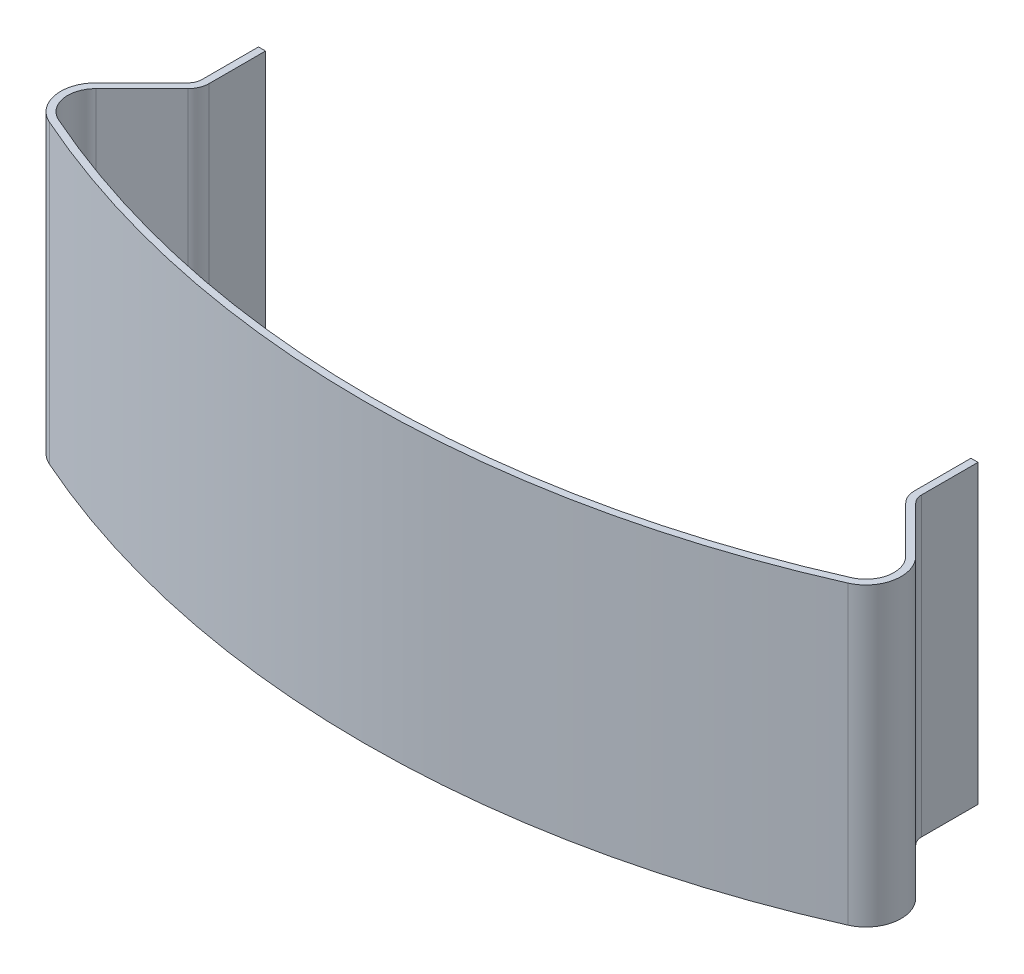
ISO-10303-21;
HEADER;
FILE_DESCRIPTION(('STEP AP214'),'2;1');
FILE_NAME('part.step','',(''),(''),'','','');
FILE_SCHEMA(('AUTOMOTIVE_DESIGN { 1 0 10303 214 1 1 1 1 }'));
ENDSEC;
DATA;
#1=APPLICATION_CONTEXT('core data for automotive mechanical design processes');
#2=APPLICATION_PROTOCOL_DEFINITION('international standard','automotive_design',2000,#1);
#3=PRODUCT_CONTEXT('',#1,'mechanical');
#4=PRODUCT('Part','Part','',(#3));
#5=PRODUCT_RELATED_PRODUCT_CATEGORY('part','',(#4));
#6=PRODUCT_DEFINITION_FORMATION('','',#4);
#7=PRODUCT_DEFINITION_CONTEXT('part definition',#1,'design');
#8=PRODUCT_DEFINITION('design','',#6,#7);
#9=PRODUCT_DEFINITION_SHAPE('','',#8);
#10=(LENGTH_UNIT() NAMED_UNIT(*) SI_UNIT(.MILLI.,.METRE.));
#11=(NAMED_UNIT(*) PLANE_ANGLE_UNIT() SI_UNIT($,.RADIAN.));
#12=(NAMED_UNIT(*) SI_UNIT($,.STERADIAN.) SOLID_ANGLE_UNIT());
#13=UNCERTAINTY_MEASURE_WITH_UNIT(LENGTH_MEASURE(1.E-05),#10,'distance_accuracy_value','');
#14=(GEOMETRIC_REPRESENTATION_CONTEXT(3) GLOBAL_UNCERTAINTY_ASSIGNED_CONTEXT((#13)) GLOBAL_UNIT_ASSIGNED_CONTEXT((#10,
#11,#12)) REPRESENTATION_CONTEXT('',''));
#15=CARTESIAN_POINT('',(0.,0.,0.));
#16=DIRECTION('',(0.,0.,1.));
#17=DIRECTION('',(1.,0.,0.));
#18=AXIS2_PLACEMENT_3D('',#15,#16,#17);
#19=CARTESIAN_POINT('',(-54.5767367898602,42.,123.476231726476));
#20=DIRECTION('',(0.,-1.,0.));
#21=DIRECTION('',(0.,0.,-1.));
#22=AXIS2_PLACEMENT_3D('',#19,#20,#21);
#23=CYLINDRICAL_SURFACE('',#22,4.9999999999998);
#24=CARTESIAN_POINT('',(-54.5767367898602,0.,123.476231726476));
#25=DIRECTION('',(0.,1.,0.));
#26=DIRECTION('',(0.,0.,-1.));
#27=AXIS2_PLACEMENT_3D('',#24,#25,#26);
#28=CIRCLE('',#27,4.9999999999998);
#29=CARTESIAN_POINT('',(-58.1122706957928,0.,119.940697820543));
#30=VERTEX_POINT('',#29);
#31=CARTESIAN_POINT('',(-56.5980974117069,0.,128.049425494123));
#32=VERTEX_POINT('',#31);
#33=EDGE_CURVE('E201',#30,#32,#28,.T.);
#34=ORIENTED_EDGE('',*,*,#33,.T.);
#35=DIRECTION('',(0.,-1.,0.));
#36=VECTOR('',#35,1.);
#37=CARTESIAN_POINT('',(-56.5980974117069,42.,128.049425494123));
#38=LINE('',#37,#36);
#39=CARTESIAN_POINT('',(-56.5980974117069,42.,128.049425494123));
#40=VERTEX_POINT('',#39);
#41=EDGE_CURVE('E11',#40,#32,#38,.T.);
#42=ORIENTED_EDGE('',*,*,#41,.F.);
#43=CARTESIAN_POINT('',(-54.5767367898602,42.,123.476231726476));
#44=DIRECTION('',(0.,1.,0.));
#45=DIRECTION('',(0.,0.,-1.));
#46=AXIS2_PLACEMENT_3D('',#43,#44,#45);
#47=CIRCLE('',#46,4.9999999999998);
#48=CARTESIAN_POINT('',(-58.1122706957928,42.,119.940697820543));
#49=VERTEX_POINT('',#48);
#50=EDGE_CURVE('E239',#49,#40,#47,.T.);
#51=ORIENTED_EDGE('',*,*,#50,.F.);
#52=DIRECTION('',(0.,-1.,0.));
#53=VECTOR('',#52,1.);
#54=CARTESIAN_POINT('',(-58.1122706957928,42.,119.940697820543));
#55=LINE('',#54,#53);
#56=EDGE_CURVE('E197',#49,#30,#55,.T.);
#57=ORIENTED_EDGE('',*,*,#56,.T.);
#58=EDGE_LOOP('',(#34,#42,#51,#57));
#59=FACE_BOUND('',#58,.T.);
#60=ADVANCED_FACE('F33',(#59),#23,.T.);
#61=CARTESIAN_POINT('',(0.,42.,0.));
#62=DIRECTION('',(0.,-1.,0.));
#63=DIRECTION('',(0.,0.,-1.));
#64=AXIS2_PLACEMENT_3D('',#61,#62,#63);
#65=CYLINDRICAL_SURFACE('',#64,140.);
#66=CARTESIAN_POINT('',(0.,0.,0.));
#67=DIRECTION('',(0.,1.,0.));
#68=DIRECTION('',(0.,0.,1.));
#69=AXIS2_PLACEMENT_3D('',#66,#67,#68);
#70=CIRCLE('',#69,140.);
#71=CARTESIAN_POINT('',(56.5980974117069,0.,128.049425494123));
#72=VERTEX_POINT('',#71);
#73=EDGE_CURVE('E204',#32,#72,#70,.T.);
#74=ORIENTED_EDGE('',*,*,#73,.T.);
#75=DIRECTION('',(0.,-1.,0.));
#76=VECTOR('',#75,1.);
#77=CARTESIAN_POINT('',(56.5980974117069,42.,128.049425494123));
#78=LINE('',#77,#76);
#79=CARTESIAN_POINT('',(56.5980974117069,42.,128.049425494123));
#80=VERTEX_POINT('',#79);
#81=EDGE_CURVE('E41',#80,#72,#78,.T.);
#82=ORIENTED_EDGE('',*,*,#81,.F.);
#83=CARTESIAN_POINT('',(0.,42.,0.));
#84=DIRECTION('',(0.,1.,0.));
#85=DIRECTION('',(0.,0.,1.));
#86=AXIS2_PLACEMENT_3D('',#83,#84,#85);
#87=CIRCLE('',#86,140.);
#88=EDGE_CURVE('E128',#40,#80,#87,.T.);
#89=ORIENTED_EDGE('',*,*,#88,.F.);
#90=ORIENTED_EDGE('',*,*,#41,.T.);
#91=EDGE_LOOP('',(#74,#82,#89,#90));
#92=FACE_BOUND('',#91,.T.);
#93=ADVANCED_FACE('F357',(#92),#65,.T.);
#94=CARTESIAN_POINT('',(54.5767367898602,42.,123.476231726476));
#95=DIRECTION('',(0.,-1.,0.));
#96=DIRECTION('',(0.,0.,-1.));
#97=AXIS2_PLACEMENT_3D('',#94,#95,#96);
#98=CYLINDRICAL_SURFACE('',#97,4.99999999999981);
#99=CARTESIAN_POINT('',(54.5767367898602,0.,123.476231726476));
#100=DIRECTION('',(0.,1.,0.));
#101=DIRECTION('',(0.,0.,1.));
#102=AXIS2_PLACEMENT_3D('',#99,#100,#101);
#103=CIRCLE('',#102,4.99999999999981);
#104=CARTESIAN_POINT('',(58.1122706957952,0.,119.940697820546));
#105=VERTEX_POINT('',#104);
#106=EDGE_CURVE('E206',#72,#105,#103,.T.);
#107=ORIENTED_EDGE('',*,*,#106,.T.);
#108=DIRECTION('',(0.,-1.,0.));
#109=VECTOR('',#108,1.);
#110=CARTESIAN_POINT('',(58.1122706957952,42.,119.940697820546));
#111=LINE('',#110,#109);
#112=CARTESIAN_POINT('',(58.1122706957952,42.,119.940697820546));
#113=VERTEX_POINT('',#112);
#114=EDGE_CURVE('E282',#113,#105,#111,.T.);
#115=ORIENTED_EDGE('',*,*,#114,.F.);
#116=CARTESIAN_POINT('',(54.5767367898602,42.,123.476231726476));
#117=DIRECTION('',(0.,1.,0.));
#118=DIRECTION('',(0.,0.,1.));
#119=AXIS2_PLACEMENT_3D('',#116,#117,#118);
#120=CIRCLE('',#119,4.99999999999981);
#121=EDGE_CURVE('E290',#80,#113,#120,.T.);
#122=ORIENTED_EDGE('',*,*,#121,.F.);
#123=ORIENTED_EDGE('',*,*,#81,.T.);
#124=EDGE_LOOP('',(#107,#115,#122,#123));
#125=FACE_BOUND('',#124,.T.);
#126=ADVANCED_FACE('F288',(#125),#98,.T.);
#127=CARTESIAN_POINT('',(58.1122706957952,42.,119.940697820546));
#128=DIRECTION('',(-0.707106781187015,0.,0.70710678118608));
#129=DIRECTION('',(0.70710678118608,0.,0.707106781187015));
#130=AXIS2_PLACEMENT_3D('',#127,#128,#129);
#131=PLANE('',#130);
#132=DIRECTION('',(-0.70710678118608,0.,-0.707106781187015));
#133=VECTOR('',#132,1.);
#134=CARTESIAN_POINT('',(58.1122706957952,0.,119.940697820546));
#135=LINE('',#134,#133);
#136=CARTESIAN_POINT('',(51.5857864376303,0.,113.414213562372));
#137=VERTEX_POINT('',#136);
#138=EDGE_CURVE('E208',#105,#137,#135,.T.);
#139=ORIENTED_EDGE('',*,*,#138,.T.);
#140=DIRECTION('',(0.,-1.,0.));
#141=VECTOR('',#140,1.);
#142=CARTESIAN_POINT('',(51.5857864376303,42.,113.414213562372));
#143=LINE('',#142,#141);
#144=CARTESIAN_POINT('',(51.5857864376303,42.,113.414213562372));
#145=VERTEX_POINT('',#144);
#146=EDGE_CURVE('E279',#145,#137,#143,.T.);
#147=ORIENTED_EDGE('',*,*,#146,.F.);
#148=DIRECTION('',(-0.70710678118608,0.,-0.707106781187015));
#149=VECTOR('',#148,1.);
#150=CARTESIAN_POINT('',(58.1122706957952,42.,119.940697820546));
#151=LINE('',#150,#149);
#152=EDGE_CURVE('E308',#113,#145,#151,.T.);
#153=ORIENTED_EDGE('',*,*,#152,.F.);
#154=ORIENTED_EDGE('',*,*,#114,.T.);
#155=EDGE_LOOP('',(#139,#147,#153,#154));
#156=FACE_BOUND('',#155,.T.);
#157=ADVANCED_FACE('F299',(#156),#131,.F.);
#158=CARTESIAN_POINT('',(53.0000000000044,42.,112.));
#159=DIRECTION('',(0.,-1.,0.));
#160=DIRECTION('',(0.,0.,-1.));
#161=AXIS2_PLACEMENT_3D('',#158,#159,#160);
#162=CYLINDRICAL_SURFACE('',#161,2.);
#163=CARTESIAN_POINT('',(53.0000000000044,0.,112.));
#164=DIRECTION('',(0.,-1.,0.));
#165=DIRECTION('',(0.,0.,-1.));
#166=AXIS2_PLACEMENT_3D('',#163,#164,#165);
#167=CIRCLE('',#166,2.);
#168=CARTESIAN_POINT('',(51.0000000000044,0.,112.));
#169=VERTEX_POINT('',#168);
#170=EDGE_CURVE('E210',#137,#169,#167,.T.);
#171=ORIENTED_EDGE('',*,*,#170,.T.);
#172=DIRECTION('',(0.,-1.,0.));
#173=VECTOR('',#172,1.);
#174=CARTESIAN_POINT('',(51.0000000000044,42.,112.));
#175=LINE('',#174,#173);
#176=CARTESIAN_POINT('',(51.0000000000044,42.,112.));
#177=VERTEX_POINT('',#176);
#178=EDGE_CURVE('E276',#177,#169,#175,.T.);
#179=ORIENTED_EDGE('',*,*,#178,.F.);
#180=CARTESIAN_POINT('',(53.0000000000044,42.,112.));
#181=DIRECTION('',(0.,-1.,0.));
#182=DIRECTION('',(0.,0.,-1.));
#183=AXIS2_PLACEMENT_3D('',#180,#181,#182);
#184=CIRCLE('',#183,2.);
#185=EDGE_CURVE('E305',#145,#177,#184,.T.);
#186=ORIENTED_EDGE('',*,*,#185,.F.);
#187=ORIENTED_EDGE('',*,*,#146,.T.);
#188=EDGE_LOOP('',(#171,#179,#186,#187));
#189=FACE_BOUND('',#188,.T.);
#190=ADVANCED_FACE('F303',(#189),#162,.F.);
#191=CARTESIAN_POINT('',(51.0000000000044,42.,112.));
#192=DIRECTION('',(-1.,0.,0.));
#193=DIRECTION('',(0.,0.,1.));
#194=AXIS2_PLACEMENT_3D('',#191,#192,#193);
#195=PLANE('',#194);
#196=DIRECTION('',(0.,0.,-1.));
#197=VECTOR('',#196,1.);
#198=CARTESIAN_POINT('',(51.0000000000044,0.,112.));
#199=LINE('',#198,#197);
#200=CARTESIAN_POINT('',(51.0000000000044,0.,104.));
#201=VERTEX_POINT('',#200);
#202=EDGE_CURVE('E212',#169,#201,#199,.T.);
#203=ORIENTED_EDGE('',*,*,#202,.T.);
#204=DIRECTION('',(0.,-1.,0.));
#205=VECTOR('',#204,1.);
#206=CARTESIAN_POINT('',(51.0000000000044,42.,104.));
#207=LINE('',#206,#205);
#208=CARTESIAN_POINT('',(51.0000000000044,42.,104.));
#209=VERTEX_POINT('',#208);
#210=EDGE_CURVE('E273',#209,#201,#207,.T.);
#211=ORIENTED_EDGE('',*,*,#210,.F.);
#212=DIRECTION('',(0.,0.,-1.));
#213=VECTOR('',#212,1.);
#214=CARTESIAN_POINT('',(51.0000000000044,42.,112.));
#215=LINE('',#214,#213);
#216=EDGE_CURVE('E307',#177,#209,#215,.T.);
#217=ORIENTED_EDGE('',*,*,#216,.F.);
#218=ORIENTED_EDGE('',*,*,#178,.T.);
#219=EDGE_LOOP('',(#203,#211,#217,#218));
#220=FACE_BOUND('',#219,.T.);
#221=ADVANCED_FACE('F370',(#220),#195,.F.);
#222=CARTESIAN_POINT('',(51.0000000000044,42.,104.));
#223=DIRECTION('',(0.,0.,1.));
#224=DIRECTION('',(1.,0.,0.));
#225=AXIS2_PLACEMENT_3D('',#222,#223,#224);
#226=PLANE('',#225);
#227=DIRECTION('',(-1.,0.,0.));
#228=VECTOR('',#227,1.);
#229=CARTESIAN_POINT('',(51.0000000000044,0.,104.));
#230=LINE('',#229,#228);
#231=CARTESIAN_POINT('',(50.0000000000043,0.,104.));
#232=VERTEX_POINT('',#231);
#233=EDGE_CURVE('E214',#201,#232,#230,.T.);
#234=ORIENTED_EDGE('',*,*,#233,.T.);
#235=DIRECTION('',(0.,-1.,0.));
#236=VECTOR('',#235,1.);
#237=CARTESIAN_POINT('',(50.0000000000043,42.,104.));
#238=LINE('',#237,#236);
#239=CARTESIAN_POINT('',(50.0000000000043,42.,104.));
#240=VERTEX_POINT('',#239);
#241=EDGE_CURVE('E270',#240,#232,#238,.T.);
#242=ORIENTED_EDGE('',*,*,#241,.F.);
#243=DIRECTION('',(-1.,0.,0.));
#244=VECTOR('',#243,1.);
#245=CARTESIAN_POINT('',(51.0000000000044,42.,104.));
#246=LINE('',#245,#244);
#247=EDGE_CURVE('E310',#209,#240,#246,.T.);
#248=ORIENTED_EDGE('',*,*,#247,.F.);
#249=ORIENTED_EDGE('',*,*,#210,.T.);
#250=EDGE_LOOP('',(#234,#242,#248,#249));
#251=FACE_BOUND('',#250,.T.);
#252=ADVANCED_FACE('F373',(#251),#226,.F.);
#253=CARTESIAN_POINT('',(50.0000000000043,42.,104.));
#254=DIRECTION('',(1.,0.,0.));
#255=DIRECTION('',(0.,0.,-1.));
#256=AXIS2_PLACEMENT_3D('',#253,#254,#255);
#257=PLANE('',#256);
#258=DIRECTION('',(0.,0.,1.));
#259=VECTOR('',#258,1.);
#260=CARTESIAN_POINT('',(50.0000000000043,0.,104.));
#261=LINE('',#260,#259);
#262=CARTESIAN_POINT('',(50.0000000000043,0.,112.));
#263=VERTEX_POINT('',#262);
#264=EDGE_CURVE('E216',#232,#263,#261,.T.);
#265=ORIENTED_EDGE('',*,*,#264,.T.);
#266=DIRECTION('',(0.,-1.,0.));
#267=VECTOR('',#266,1.);
#268=CARTESIAN_POINT('',(50.0000000000043,42.,112.));
#269=LINE('',#268,#267);
#270=CARTESIAN_POINT('',(50.0000000000043,42.,112.));
#271=VERTEX_POINT('',#270);
#272=EDGE_CURVE('E267',#271,#263,#269,.T.);
#273=ORIENTED_EDGE('',*,*,#272,.F.);
#274=DIRECTION('',(0.,0.,1.));
#275=VECTOR('',#274,1.);
#276=CARTESIAN_POINT('',(50.0000000000043,42.,104.));
#277=LINE('',#276,#275);
#278=EDGE_CURVE('E316',#240,#271,#277,.T.);
#279=ORIENTED_EDGE('',*,*,#278,.F.);
#280=ORIENTED_EDGE('',*,*,#241,.T.);
#281=EDGE_LOOP('',(#265,#273,#279,#280));
#282=FACE_BOUND('',#281,.T.);
#283=ADVANCED_FACE('F377',(#282),#257,.F.);
#284=CARTESIAN_POINT('',(53.0000000000044,42.,112.));
#285=DIRECTION('',(0.,-1.,0.));
#286=DIRECTION('',(0.,0.,-1.));
#287=AXIS2_PLACEMENT_3D('',#284,#285,#286);
#288=CYLINDRICAL_SURFACE('',#287,3.00000000000002);
#289=CARTESIAN_POINT('',(53.0000000000044,0.,112.));
#290=DIRECTION('',(0.,1.,0.));
#291=DIRECTION('',(0.,0.,-1.));
#292=AXIS2_PLACEMENT_3D('',#289,#290,#291);
#293=CIRCLE('',#292,3.00000000000002);
#294=CARTESIAN_POINT('',(50.8786796564433,0.,114.121320343558));
#295=VERTEX_POINT('',#294);
#296=EDGE_CURVE('E218',#263,#295,#293,.T.);
#297=ORIENTED_EDGE('',*,*,#296,.T.);
#298=DIRECTION('',(0.,-1.,0.));
#299=VECTOR('',#298,1.);
#300=CARTESIAN_POINT('',(50.8786796564433,42.,114.121320343558));
#301=LINE('',#300,#299);
#302=CARTESIAN_POINT('',(50.8786796564433,42.,114.121320343558));
#303=VERTEX_POINT('',#302);
#304=EDGE_CURVE('E264',#303,#295,#301,.T.);
#305=ORIENTED_EDGE('',*,*,#304,.F.);
#306=CARTESIAN_POINT('',(53.0000000000044,42.,112.));
#307=DIRECTION('',(0.,1.,0.));
#308=DIRECTION('',(0.,0.,-1.));
#309=AXIS2_PLACEMENT_3D('',#306,#307,#308);
#310=CIRCLE('',#309,3.00000000000002);
#311=EDGE_CURVE('E318',#271,#303,#310,.T.);
#312=ORIENTED_EDGE('',*,*,#311,.F.);
#313=ORIENTED_EDGE('',*,*,#272,.T.);
#314=EDGE_LOOP('',(#297,#305,#312,#313));
#315=FACE_BOUND('',#314,.T.);
#316=ADVANCED_FACE('F381',(#315),#288,.T.);
#317=CARTESIAN_POINT('',(57.4051639146092,42.,120.647804601733));
#318=DIRECTION('',(0.707106781187015,0.,-0.70710678118608));
#319=DIRECTION('',(-0.70710678118608,0.,-0.707106781187016));
#320=AXIS2_PLACEMENT_3D('',#317,#318,#319);
#321=PLANE('',#320);
#322=DIRECTION('',(0.70710678118608,0.,0.707106781187016));
#323=VECTOR('',#322,1.);
#324=CARTESIAN_POINT('',(57.4051639146092,0.,120.647804601733));
#325=LINE('',#324,#323);
#326=CARTESIAN_POINT('',(57.4051639146092,0.,120.647804601733));
#327=VERTEX_POINT('',#326);
#328=EDGE_CURVE('E220',#295,#327,#325,.T.);
#329=ORIENTED_EDGE('',*,*,#328,.T.);
#330=DIRECTION('',(0.,-1.,0.));
#331=VECTOR('',#330,1.);
#332=CARTESIAN_POINT('',(57.4051639146092,42.,120.647804601733));
#333=LINE('',#332,#331);
#334=CARTESIAN_POINT('',(57.4051639146092,42.,120.647804601733));
#335=VERTEX_POINT('',#334);
#336=EDGE_CURVE('E261',#335,#327,#333,.T.);
#337=ORIENTED_EDGE('',*,*,#336,.F.);
#338=DIRECTION('',(0.70710678118608,0.,0.707106781187016));
#339=VECTOR('',#338,1.);
#340=CARTESIAN_POINT('',(57.4051639146092,42.,120.647804601733));
#341=LINE('',#340,#339);
#342=EDGE_CURVE('E320',#303,#335,#341,.T.);
#343=ORIENTED_EDGE('',*,*,#342,.F.);
#344=ORIENTED_EDGE('',*,*,#304,.T.);
#345=EDGE_LOOP('',(#329,#337,#343,#344));
#346=FACE_BOUND('',#345,.T.);
#347=ADVANCED_FACE('F385',(#346),#321,.F.);
#348=CARTESIAN_POINT('',(54.5767367898602,42.,123.476231726476));
#349=DIRECTION('',(0.,-1.,0.));
#350=DIRECTION('',(0.,0.,-1.));
#351=AXIS2_PLACEMENT_3D('',#348,#349,#350);
#352=CYLINDRICAL_SURFACE('',#351,3.99999999999978);
#353=CARTESIAN_POINT('',(54.5767367898602,0.,123.476231726476));
#354=DIRECTION('',(0.,-1.,0.));
#355=DIRECTION('',(0.,0.,1.));
#356=AXIS2_PLACEMENT_3D('',#353,#354,#355);
#357=CIRCLE('',#356,3.99999999999978);
#358=CARTESIAN_POINT('',(56.1938252873375,0.,127.134786740593));
#359=VERTEX_POINT('',#358);
#360=EDGE_CURVE('E222',#327,#359,#357,.T.);
#361=ORIENTED_EDGE('',*,*,#360,.T.);
#362=DIRECTION('',(0.,-1.,0.));
#363=VECTOR('',#362,1.);
#364=CARTESIAN_POINT('',(56.1938252873375,42.,127.134786740593));
#365=LINE('',#364,#363);
#366=CARTESIAN_POINT('',(56.1938252873375,42.,127.134786740593));
#367=VERTEX_POINT('',#366);
#368=EDGE_CURVE('E258',#367,#359,#365,.T.);
#369=ORIENTED_EDGE('',*,*,#368,.F.);
#370=CARTESIAN_POINT('',(54.5767367898602,42.,123.476231726476));
#371=DIRECTION('',(0.,-1.,0.));
#372=DIRECTION('',(0.,0.,1.));
#373=AXIS2_PLACEMENT_3D('',#370,#371,#372);
#374=CIRCLE('',#373,3.99999999999978);
#375=EDGE_CURVE('E322',#335,#367,#374,.T.);
#376=ORIENTED_EDGE('',*,*,#375,.F.);
#377=ORIENTED_EDGE('',*,*,#336,.T.);
#378=EDGE_LOOP('',(#361,#369,#376,#377));
#379=FACE_BOUND('',#378,.T.);
#380=ADVANCED_FACE('F389',(#379),#352,.F.);
#381=CARTESIAN_POINT('',(0.,42.,0.));
#382=DIRECTION('',(0.,-1.,0.));
#383=DIRECTION('',(0.,0.,-1.));
#384=AXIS2_PLACEMENT_3D('',#381,#382,#383);
#385=CYLINDRICAL_SURFACE('',#384,139.);
#386=CARTESIAN_POINT('',(0.,0.,0.));
#387=DIRECTION('',(0.,-1.,0.));
#388=DIRECTION('',(0.,0.,1.));
#389=AXIS2_PLACEMENT_3D('',#386,#387,#388);
#390=CIRCLE('',#389,139.);
#391=CARTESIAN_POINT('',(-56.1938252873375,0.,127.134786740593));
#392=VERTEX_POINT('',#391);
#393=EDGE_CURVE('E224',#359,#392,#390,.T.);
#394=ORIENTED_EDGE('',*,*,#393,.T.);
#395=DIRECTION('',(0.,-1.,0.));
#396=VECTOR('',#395,1.);
#397=CARTESIAN_POINT('',(-56.1938252873375,42.,127.134786740593));
#398=LINE('',#397,#396);
#399=CARTESIAN_POINT('',(-56.1938252873375,42.,127.134786740593));
#400=VERTEX_POINT('',#399);
#401=EDGE_CURVE('E255',#400,#392,#398,.T.);
#402=ORIENTED_EDGE('',*,*,#401,.F.);
#403=CARTESIAN_POINT('',(0.,42.,0.));
#404=DIRECTION('',(0.,-1.,0.));
#405=DIRECTION('',(0.,0.,1.));
#406=AXIS2_PLACEMENT_3D('',#403,#404,#405);
#407=CIRCLE('',#406,139.);
#408=EDGE_CURVE('E324',#367,#400,#407,.T.);
#409=ORIENTED_EDGE('',*,*,#408,.F.);
#410=ORIENTED_EDGE('',*,*,#368,.T.);
#411=EDGE_LOOP('',(#394,#402,#409,#410));
#412=FACE_BOUND('',#411,.T.);
#413=ADVANCED_FACE('F393',(#412),#385,.F.);
#414=CARTESIAN_POINT('',(-54.5767367898602,42.,123.476231726476));
#415=DIRECTION('',(0.,-1.,0.));
#416=DIRECTION('',(0.,0.,-1.));
#417=AXIS2_PLACEMENT_3D('',#414,#415,#416);
#418=CYLINDRICAL_SURFACE('',#417,3.99999999999978);
#419=CARTESIAN_POINT('',(-54.5767367898602,0.,123.476231726476));
#420=DIRECTION('',(0.,-1.,0.));
#421=DIRECTION('',(0.,0.,1.));
#422=AXIS2_PLACEMENT_3D('',#419,#420,#421);
#423=CIRCLE('',#422,3.99999999999978);
#424=CARTESIAN_POINT('',(-57.4051639146063,0.,120.64780460173));
#425=VERTEX_POINT('',#424);
#426=EDGE_CURVE('E226',#392,#425,#423,.T.);
#427=ORIENTED_EDGE('',*,*,#426,.T.);
#428=DIRECTION('',(0.,-1.,0.));
#429=VECTOR('',#428,1.);
#430=CARTESIAN_POINT('',(-57.4051639146063,42.,120.64780460173));
#431=LINE('',#430,#429);
#432=CARTESIAN_POINT('',(-57.4051639146063,42.,120.64780460173));
#433=VERTEX_POINT('',#432);
#434=EDGE_CURVE('E252',#433,#425,#431,.T.);
#435=ORIENTED_EDGE('',*,*,#434,.F.);
#436=CARTESIAN_POINT('',(-54.5767367898602,42.,123.476231726476));
#437=DIRECTION('',(0.,-1.,0.));
#438=DIRECTION('',(0.,0.,1.));
#439=AXIS2_PLACEMENT_3D('',#436,#437,#438);
#440=CIRCLE('',#439,3.99999999999978);
#441=EDGE_CURVE('E326',#400,#433,#440,.T.);
#442=ORIENTED_EDGE('',*,*,#441,.F.);
#443=ORIENTED_EDGE('',*,*,#401,.T.);
#444=EDGE_LOOP('',(#427,#435,#442,#443));
#445=FACE_BOUND('',#444,.T.);
#446=ADVANCED_FACE('F397',(#445),#418,.F.);
#447=CARTESIAN_POINT('',(-50.878679656436,42.,114.12132034356));
#448=DIRECTION('',(-0.707106781186547,0.,-0.707106781186548));
#449=DIRECTION('',(-0.707106781186548,0.,0.707106781186547));
#450=AXIS2_PLACEMENT_3D('',#447,#448,#449);
#451=PLANE('',#450);
#452=DIRECTION('',(0.707106781186548,0.,-0.707106781186547));
#453=VECTOR('',#452,1.);
#454=CARTESIAN_POINT('',(-50.878679656436,0.,114.12132034356));
#455=LINE('',#454,#453);
#456=CARTESIAN_POINT('',(-50.878679656436,0.,114.12132034356));
#457=VERTEX_POINT('',#456);
#458=EDGE_CURVE('E228',#425,#457,#455,.T.);
#459=ORIENTED_EDGE('',*,*,#458,.T.);
#460=DIRECTION('',(0.,-1.,0.));
#461=VECTOR('',#460,1.);
#462=CARTESIAN_POINT('',(-50.878679656436,42.,114.12132034356));
#463=LINE('',#462,#461);
#464=CARTESIAN_POINT('',(-50.878679656436,42.,114.12132034356));
#465=VERTEX_POINT('',#464);
#466=EDGE_CURVE('E249',#465,#457,#463,.T.);
#467=ORIENTED_EDGE('',*,*,#466,.F.);
#468=DIRECTION('',(0.707106781186548,0.,-0.707106781186547));
#469=VECTOR('',#468,1.);
#470=CARTESIAN_POINT('',(-50.878679656436,42.,114.12132034356));
#471=LINE('',#470,#469);
#472=EDGE_CURVE('E328',#433,#465,#471,.T.);
#473=ORIENTED_EDGE('',*,*,#472,.F.);
#474=ORIENTED_EDGE('',*,*,#434,.T.);
#475=EDGE_LOOP('',(#459,#467,#473,#474));
#476=FACE_BOUND('',#475,.T.);
#477=ADVANCED_FACE('F401',(#476),#451,.F.);
#478=CARTESIAN_POINT('',(-52.9999999999957,42.,112.));
#479=DIRECTION('',(0.,-1.,0.));
#480=DIRECTION('',(0.,0.,-1.));
#481=AXIS2_PLACEMENT_3D('',#478,#479,#480);
#482=CYLINDRICAL_SURFACE('',#481,3.);
#483=CARTESIAN_POINT('',(-52.9999999999957,0.,112.));
#484=DIRECTION('',(0.,1.,0.));
#485=DIRECTION('',(0.,0.,-1.));
#486=AXIS2_PLACEMENT_3D('',#483,#484,#485);
#487=CIRCLE('',#486,3.);
#488=CARTESIAN_POINT('',(-49.9999999999957,0.,112.));
#489=VERTEX_POINT('',#488);
#490=EDGE_CURVE('E230',#457,#489,#487,.T.);
#491=ORIENTED_EDGE('',*,*,#490,.T.);
#492=DIRECTION('',(0.,-1.,0.));
#493=VECTOR('',#492,1.);
#494=CARTESIAN_POINT('',(-49.9999999999957,42.,112.));
#495=LINE('',#494,#493);
#496=CARTESIAN_POINT('',(-49.9999999999957,42.,112.));
#497=VERTEX_POINT('',#496);
#498=EDGE_CURVE('E246',#497,#489,#495,.T.);
#499=ORIENTED_EDGE('',*,*,#498,.F.);
#500=CARTESIAN_POINT('',(-52.9999999999957,42.,112.));
#501=DIRECTION('',(0.,1.,0.));
#502=DIRECTION('',(0.,0.,-1.));
#503=AXIS2_PLACEMENT_3D('',#500,#501,#502);
#504=CIRCLE('',#503,3.);
#505=EDGE_CURVE('E330',#465,#497,#504,.T.);
#506=ORIENTED_EDGE('',*,*,#505,.F.);
#507=ORIENTED_EDGE('',*,*,#466,.T.);
#508=EDGE_LOOP('',(#491,#499,#506,#507));
#509=FACE_BOUND('',#508,.T.);
#510=ADVANCED_FACE('F405',(#509),#482,.T.);
#511=CARTESIAN_POINT('',(-49.9999999999957,42.,104.));
#512=DIRECTION('',(-1.,0.,0.));
#513=DIRECTION('',(0.,0.,1.));
#514=AXIS2_PLACEMENT_3D('',#511,#512,#513);
#515=PLANE('',#514);
#516=DIRECTION('',(0.,0.,-1.));
#517=VECTOR('',#516,1.);
#518=CARTESIAN_POINT('',(-49.9999999999957,0.,104.));
#519=LINE('',#518,#517);
#520=CARTESIAN_POINT('',(-49.9999999999957,0.,104.));
#521=VERTEX_POINT('',#520);
#522=EDGE_CURVE('E232',#489,#521,#519,.T.);
#523=ORIENTED_EDGE('',*,*,#522,.T.);
#524=DIRECTION('',(0.,-1.,0.));
#525=VECTOR('',#524,1.);
#526=CARTESIAN_POINT('',(-49.9999999999957,42.,104.));
#527=LINE('',#526,#525);
#528=CARTESIAN_POINT('',(-49.9999999999957,42.,104.));
#529=VERTEX_POINT('',#528);
#530=EDGE_CURVE('E243',#529,#521,#527,.T.);
#531=ORIENTED_EDGE('',*,*,#530,.F.);
#532=DIRECTION('',(0.,0.,-1.));
#533=VECTOR('',#532,1.);
#534=CARTESIAN_POINT('',(-49.9999999999957,42.,104.));
#535=LINE('',#534,#533);
#536=EDGE_CURVE('E332',#497,#529,#535,.T.);
#537=ORIENTED_EDGE('',*,*,#536,.F.);
#538=ORIENTED_EDGE('',*,*,#498,.T.);
#539=EDGE_LOOP('',(#523,#531,#537,#538));
#540=FACE_BOUND('',#539,.T.);
#541=ADVANCED_FACE('F338',(#540),#515,.F.);
#542=CARTESIAN_POINT('',(-50.9999999999957,42.,104.));
#543=DIRECTION('',(0.,0.,1.));
#544=DIRECTION('',(1.,0.,0.));
#545=AXIS2_PLACEMENT_3D('',#542,#543,#544);
#546=PLANE('',#545);
#547=DIRECTION('',(-1.,0.,0.));
#548=VECTOR('',#547,1.);
#549=CARTESIAN_POINT('',(-50.9999999999957,0.,104.));
#550=LINE('',#549,#548);
#551=CARTESIAN_POINT('',(-50.9999999999957,0.,104.));
#552=VERTEX_POINT('',#551);
#553=EDGE_CURVE('E234',#521,#552,#550,.T.);
#554=ORIENTED_EDGE('',*,*,#553,.T.);
#555=DIRECTION('',(0.,-1.,0.));
#556=VECTOR('',#555,1.);
#557=CARTESIAN_POINT('',(-50.9999999999957,42.,104.));
#558=LINE('',#557,#556);
#559=CARTESIAN_POINT('',(-50.9999999999957,42.,104.));
#560=VERTEX_POINT('',#559);
#561=EDGE_CURVE('E192',#560,#552,#558,.T.);
#562=ORIENTED_EDGE('',*,*,#561,.F.);
#563=DIRECTION('',(-1.,0.,0.));
#564=VECTOR('',#563,1.);
#565=CARTESIAN_POINT('',(-50.9999999999957,42.,104.));
#566=LINE('',#565,#564);
#567=EDGE_CURVE('E183',#529,#560,#566,.T.);
#568=ORIENTED_EDGE('',*,*,#567,.F.);
#569=ORIENTED_EDGE('',*,*,#530,.T.);
#570=EDGE_LOOP('',(#554,#562,#568,#569));
#571=FACE_BOUND('',#570,.T.);
#572=ADVANCED_FACE('F342',(#571),#546,.F.);
#573=CARTESIAN_POINT('',(-50.9999999999957,42.,112.));
#574=DIRECTION('',(1.,0.,0.));
#575=DIRECTION('',(0.,0.,-1.));
#576=AXIS2_PLACEMENT_3D('',#573,#574,#575);
#577=PLANE('',#576);
#578=DIRECTION('',(0.,0.,1.));
#579=VECTOR('',#578,1.);
#580=CARTESIAN_POINT('',(-50.9999999999957,0.,112.));
#581=LINE('',#580,#579);
#582=CARTESIAN_POINT('',(-50.9999999999957,0.,112.));
#583=VERTEX_POINT('',#582);
#584=EDGE_CURVE('E191',#552,#583,#581,.T.);
#585=ORIENTED_EDGE('',*,*,#584,.T.);
#586=DIRECTION('',(0.,-1.,0.));
#587=VECTOR('',#586,1.);
#588=CARTESIAN_POINT('',(-50.9999999999957,42.,112.));
#589=LINE('',#588,#587);
#590=CARTESIAN_POINT('',(-50.9999999999957,42.,112.));
#591=VERTEX_POINT('',#590);
#592=EDGE_CURVE('E188',#591,#583,#589,.T.);
#593=ORIENTED_EDGE('',*,*,#592,.F.);
#594=DIRECTION('',(0.,0.,1.));
#595=VECTOR('',#594,1.);
#596=CARTESIAN_POINT('',(-50.9999999999957,42.,112.));
#597=LINE('',#596,#595);
#598=EDGE_CURVE('E177',#560,#591,#597,.T.);
#599=ORIENTED_EDGE('',*,*,#598,.F.);
#600=ORIENTED_EDGE('',*,*,#561,.T.);
#601=EDGE_LOOP('',(#585,#593,#599,#600));
#602=FACE_BOUND('',#601,.T.);
#603=ADVANCED_FACE('F189',(#602),#577,.F.);
#604=CARTESIAN_POINT('',(-52.9999999999957,42.,112.));
#605=DIRECTION('',(0.,-1.,0.));
#606=DIRECTION('',(0.,0.,-1.));
#607=AXIS2_PLACEMENT_3D('',#604,#605,#606);
#608=CYLINDRICAL_SURFACE('',#607,2.);
#609=CARTESIAN_POINT('',(-52.9999999999957,0.,112.));
#610=DIRECTION('',(0.,-1.,0.));
#611=DIRECTION('',(0.,0.,1.));
#612=AXIS2_PLACEMENT_3D('',#609,#610,#611);
#613=CIRCLE('',#612,2.);
#614=CARTESIAN_POINT('',(-51.5857864376226,0.,113.414213562373));
#615=VERTEX_POINT('',#614);
#616=EDGE_CURVE('E114',#583,#615,#613,.T.);
#617=ORIENTED_EDGE('',*,*,#616,.T.);
#618=DIRECTION('',(0.,-1.,0.));
#619=VECTOR('',#618,1.);
#620=CARTESIAN_POINT('',(-51.5857864376226,42.,113.414213562373));
#621=LINE('',#620,#619);
#622=CARTESIAN_POINT('',(-51.5857864376226,42.,113.414213562373));
#623=VERTEX_POINT('',#622);
#624=EDGE_CURVE('E193',#623,#615,#621,.T.);
#625=ORIENTED_EDGE('',*,*,#624,.F.);
#626=CARTESIAN_POINT('',(-52.9999999999957,42.,112.));
#627=DIRECTION('',(0.,-1.,0.));
#628=DIRECTION('',(0.,0.,1.));
#629=AXIS2_PLACEMENT_3D('',#626,#627,#628);
#630=CIRCLE('',#629,2.);
#631=EDGE_CURVE('E181',#591,#623,#630,.T.);
#632=ORIENTED_EDGE('',*,*,#631,.F.);
#633=ORIENTED_EDGE('',*,*,#592,.T.);
#634=EDGE_LOOP('',(#617,#625,#632,#633));
#635=FACE_BOUND('',#634,.T.);
#636=ADVANCED_FACE('F195',(#635),#608,.F.);
#637=CARTESIAN_POINT('',(-58.1122706957928,42.,119.940697820543));
#638=DIRECTION('',(0.707106781186546,0.,0.707106781186549));
#639=DIRECTION('',(0.707106781186549,0.,-0.707106781186546));
#640=AXIS2_PLACEMENT_3D('',#637,#638,#639);
#641=PLANE('',#640);
#642=DIRECTION('',(-0.707106781186549,0.,0.707106781186546));
#643=VECTOR('',#642,1.);
#644=CARTESIAN_POINT('',(-58.1122706957928,0.,119.940697820543));
#645=LINE('',#644,#643);
#646=EDGE_CURVE('E120',#615,#30,#645,.T.);
#647=ORIENTED_EDGE('',*,*,#646,.T.);
#648=ORIENTED_EDGE('',*,*,#56,.F.);
#649=DIRECTION('',(-0.707106781186549,0.,0.707106781186546));
#650=VECTOR('',#649,1.);
#651=CARTESIAN_POINT('',(-58.1122706957928,42.,119.940697820543));
#652=LINE('',#651,#650);
#653=EDGE_CURVE('E49',#623,#49,#652,.T.);
#654=ORIENTED_EDGE('',*,*,#653,.F.);
#655=ORIENTED_EDGE('',*,*,#624,.T.);
#656=EDGE_LOOP('',(#647,#648,#654,#655));
#657=FACE_BOUND('',#656,.T.);
#658=ADVANCED_FACE('F346',(#657),#641,.F.);
#659=CARTESIAN_POINT('',(-54.5767367898602,42.,123.476231726476));
#660=DIRECTION('',(0.,-1.,0.));
#661=DIRECTION('',(0.,0.,-1.));
#662=AXIS2_PLACEMENT_3D('',#659,#660,#661);
#663=PLANE('',#662);
#664=ORIENTED_EDGE('',*,*,#50,.T.);
#665=ORIENTED_EDGE('',*,*,#88,.T.);
#666=ORIENTED_EDGE('',*,*,#121,.T.);
#667=ORIENTED_EDGE('',*,*,#152,.T.);
#668=ORIENTED_EDGE('',*,*,#185,.T.);
#669=ORIENTED_EDGE('',*,*,#216,.T.);
#670=ORIENTED_EDGE('',*,*,#247,.T.);
#671=ORIENTED_EDGE('',*,*,#278,.T.);
#672=ORIENTED_EDGE('',*,*,#311,.T.);
#673=ORIENTED_EDGE('',*,*,#342,.T.);
#674=ORIENTED_EDGE('',*,*,#375,.T.);
#675=ORIENTED_EDGE('',*,*,#408,.T.);
#676=ORIENTED_EDGE('',*,*,#441,.T.);
#677=ORIENTED_EDGE('',*,*,#472,.T.);
#678=ORIENTED_EDGE('',*,*,#505,.T.);
#679=ORIENTED_EDGE('',*,*,#536,.T.);
#680=ORIENTED_EDGE('',*,*,#567,.T.);
#681=ORIENTED_EDGE('',*,*,#598,.T.);
#682=ORIENTED_EDGE('',*,*,#631,.T.);
#683=ORIENTED_EDGE('',*,*,#653,.T.);
#684=EDGE_LOOP('',(#664,#665,#666,#667,#668,#669,#670,#671,#672,#673,#674,#675,#676,#677,#678,
#679,#680,#681,#682,#683));
#685=FACE_BOUND('',#684,.T.);
#686=ADVANCED_FACE('F179',(#685),#663,.F.);
#687=CARTESIAN_POINT('',(-54.5767367898602,0.,123.476231726476));
#688=DIRECTION('',(0.,-1.,0.));
#689=DIRECTION('',(0.,0.,-1.));
#690=AXIS2_PLACEMENT_3D('',#687,#688,#689);
#691=PLANE('',#690);
#692=ORIENTED_EDGE('',*,*,#33,.F.);
#693=ORIENTED_EDGE('',*,*,#646,.F.);
#694=ORIENTED_EDGE('',*,*,#616,.F.);
#695=ORIENTED_EDGE('',*,*,#584,.F.);
#696=ORIENTED_EDGE('',*,*,#553,.F.);
#697=ORIENTED_EDGE('',*,*,#522,.F.);
#698=ORIENTED_EDGE('',*,*,#490,.F.);
#699=ORIENTED_EDGE('',*,*,#458,.F.);
#700=ORIENTED_EDGE('',*,*,#426,.F.);
#701=ORIENTED_EDGE('',*,*,#393,.F.);
#702=ORIENTED_EDGE('',*,*,#360,.F.);
#703=ORIENTED_EDGE('',*,*,#328,.F.);
#704=ORIENTED_EDGE('',*,*,#296,.F.);
#705=ORIENTED_EDGE('',*,*,#264,.F.);
#706=ORIENTED_EDGE('',*,*,#233,.F.);
#707=ORIENTED_EDGE('',*,*,#202,.F.);
#708=ORIENTED_EDGE('',*,*,#170,.F.);
#709=ORIENTED_EDGE('',*,*,#138,.F.);
#710=ORIENTED_EDGE('',*,*,#106,.F.);
#711=ORIENTED_EDGE('',*,*,#73,.F.);
#712=EDGE_LOOP('',(#692,#693,#694,#695,#696,#697,#698,#699,#700,#701,#702,#703,#704,#705,#706,
#707,#708,#709,#710,#711));
#713=FACE_BOUND('',#712,.T.);
#714=ADVANCED_FACE('F294',(#713),#691,.T.);
#715=CLOSED_SHELL('',(#60,#93,#126,#157,#190,#221,#252,#283,#316,#347,#380,#413,#446,#477,#510,
#541,#572,#603,#636,#658,#686,#714));
#716=MANIFOLD_SOLID_BREP('B2',#715);
#717=ADVANCED_BREP_SHAPE_REPRESENTATION('',(#18,#716),#14);
#718=SHAPE_DEFINITION_REPRESENTATION(#9,#717);
ENDSEC;
END-ISO-10303-21;
